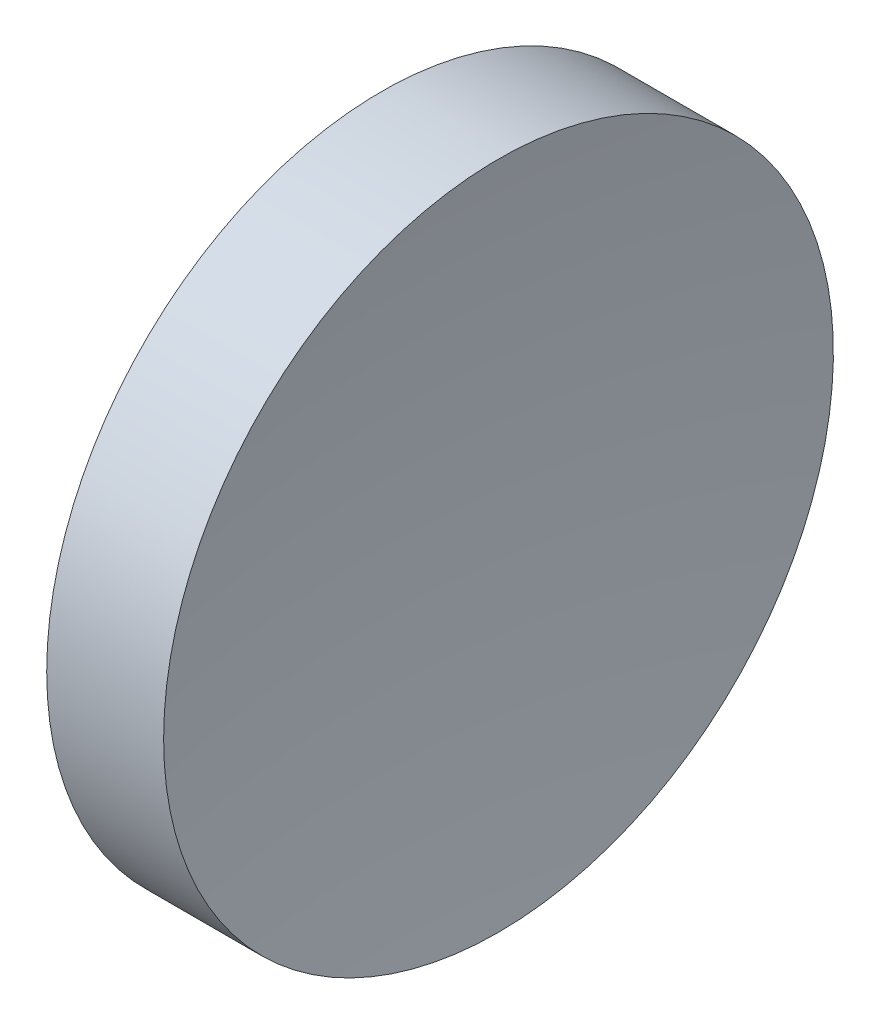
ISO-10303-21;
HEADER;
FILE_DESCRIPTION(('STEP AP214'),'2;1');
FILE_NAME('part.step','',(''),(''),'','','');
FILE_SCHEMA(('AUTOMOTIVE_DESIGN { 1 0 10303 214 1 1 1 1 }'));
ENDSEC;
DATA;
#1=APPLICATION_CONTEXT('core data for automotive mechanical design processes');
#2=APPLICATION_PROTOCOL_DEFINITION('international standard','automotive_design',2000,#1);
#3=PRODUCT_CONTEXT('',#1,'mechanical');
#4=PRODUCT('Part','Part','',(#3));
#5=PRODUCT_RELATED_PRODUCT_CATEGORY('part','',(#4));
#6=PRODUCT_DEFINITION_FORMATION('','',#4);
#7=PRODUCT_DEFINITION_CONTEXT('part definition',#1,'design');
#8=PRODUCT_DEFINITION('design','',#6,#7);
#9=PRODUCT_DEFINITION_SHAPE('','',#8);
#10=(LENGTH_UNIT() NAMED_UNIT(*) SI_UNIT(.MILLI.,.METRE.));
#11=(NAMED_UNIT(*) PLANE_ANGLE_UNIT() SI_UNIT($,.RADIAN.));
#12=(NAMED_UNIT(*) SI_UNIT($,.STERADIAN.) SOLID_ANGLE_UNIT());
#13=UNCERTAINTY_MEASURE_WITH_UNIT(LENGTH_MEASURE(1.E-05),#10,'distance_accuracy_value','');
#14=(GEOMETRIC_REPRESENTATION_CONTEXT(3) GLOBAL_UNCERTAINTY_ASSIGNED_CONTEXT((#13)) GLOBAL_UNIT_ASSIGNED_CONTEXT((#10,
#11,#12)) REPRESENTATION_CONTEXT('',''));
#15=CARTESIAN_POINT('',(0.,0.,0.));
#16=DIRECTION('',(0.,0.,1.));
#17=DIRECTION('',(1.,0.,0.));
#18=AXIS2_PLACEMENT_3D('',#15,#16,#17);
#19=CARTESIAN_POINT('',(209.806834178548,71.1939890865937,0.));
#20=DIRECTION('',(-1.,0.,0.));
#21=DIRECTION('',(0.,-1.,0.));
#22=AXIS2_PLACEMENT_3D('',#19,#20,#21);
#23=SPHERICAL_SURFACE('',#22,86.8);
#24=CARTESIAN_POINT('',(123.940950382945,71.1939890865937,0.));
#25=DIRECTION('',(-1.,0.,0.));
#26=DIRECTION('',(0.,0.,1.));
#27=AXIS2_PLACEMENT_3D('',#24,#25,#26);
#28=CIRCLE('',#27,12.7);
#29=CARTESIAN_POINT('',(123.940950382945,71.1939890865937,12.7));
#30=VERTEX_POINT('',#29);
#31=EDGE_CURVE('E10',#30,#30,#28,.T.);
#32=ORIENTED_EDGE('',*,*,#31,.F.);
#33=EDGE_LOOP('',(#32));
#34=FACE_BOUND('',#33,.T.);
#35=ADVANCED_FACE('F35',(#34),#23,.F.);
#36=CARTESIAN_POINT('',(111.955229757561,71.1939890865937,0.));
#37=DIRECTION('',(-1.,0.,0.));
#38=DIRECTION('',(0.,0.,1.));
#39=AXIS2_PLACEMENT_3D('',#36,#37,#38);
#40=CYLINDRICAL_SURFACE('',#39,12.7);
#41=CARTESIAN_POINT('',(119.506834178548,71.1939890865937,0.));
#42=DIRECTION('',(-1.,0.,0.));
#43=DIRECTION('',(0.,0.,1.));
#44=AXIS2_PLACEMENT_3D('',#41,#42,#43);
#45=CIRCLE('',#44,12.7);
#46=CARTESIAN_POINT('',(119.506834178548,71.1939890865937,12.7));
#47=VERTEX_POINT('',#46);
#48=EDGE_CURVE('E41',#47,#47,#45,.T.);
#49=ORIENTED_EDGE('',*,*,#48,.F.);
#50=EDGE_LOOP('',(#49));
#51=FACE_BOUND('',#50,.T.);
#52=ORIENTED_EDGE('',*,*,#31,.T.);
#53=EDGE_LOOP('',(#52));
#54=FACE_BOUND('',#53,.T.);
#55=ADVANCED_FACE('F49',(#51,#54),#40,.T.);
#56=CARTESIAN_POINT('',(119.506834178548,71.1939890865937,0.));
#57=DIRECTION('',(1.,0.,0.));
#58=DIRECTION('',(0.,0.,-1.));
#59=AXIS2_PLACEMENT_3D('',#56,#57,#58);
#60=PLANE('',#59);
#61=ORIENTED_EDGE('',*,*,#48,.T.);
#62=EDGE_LOOP('',(#61));
#63=FACE_BOUND('',#62,.T.);
#64=ADVANCED_FACE('F47',(#63),#60,.F.);
#65=CLOSED_SHELL('',(#35,#55,#64));
#66=MANIFOLD_SOLID_BREP('B2',#65);
#67=ADVANCED_BREP_SHAPE_REPRESENTATION('',(#18,#66),#14);
#68=SHAPE_DEFINITION_REPRESENTATION(#9,#67);
ENDSEC;
END-ISO-10303-21;
